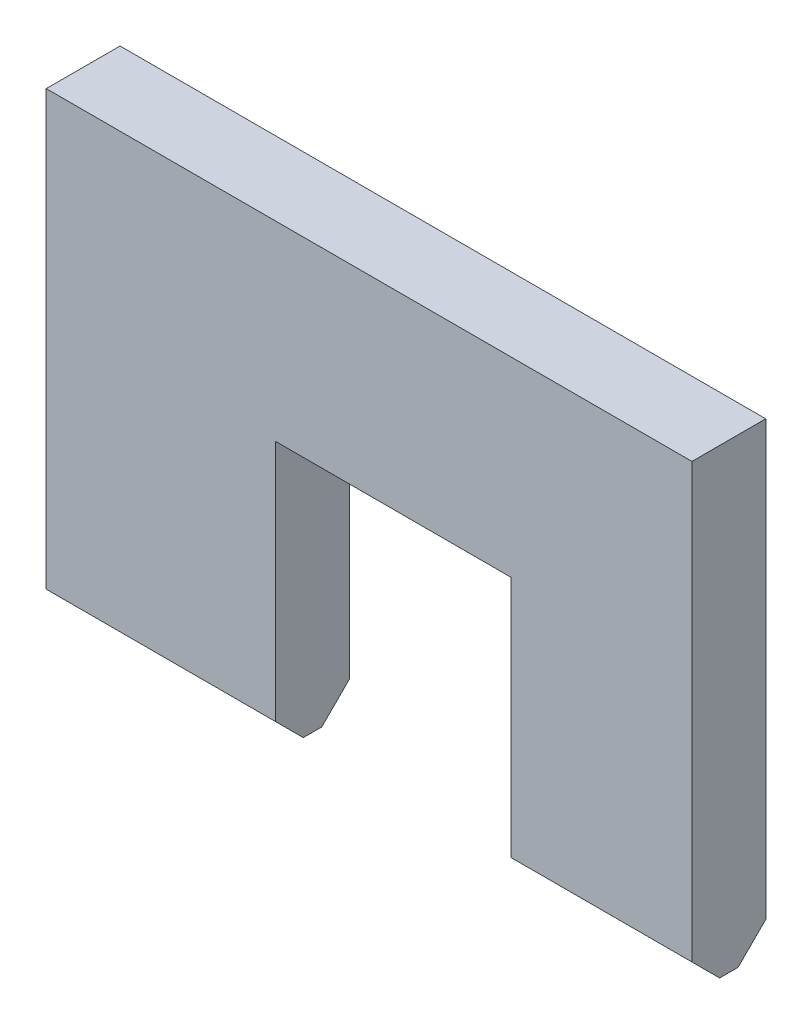
ISO-10303-21;
HEADER;
FILE_DESCRIPTION(('STEP AP214'),'2;1');
FILE_NAME('part.step','',(''),(''),'','','');
FILE_SCHEMA(('AUTOMOTIVE_DESIGN { 1 0 10303 214 1 1 1 1 }'));
ENDSEC;
DATA;
#1=APPLICATION_CONTEXT('core data for automotive mechanical design processes');
#2=APPLICATION_PROTOCOL_DEFINITION('international standard','automotive_design',2000,#1);
#3=PRODUCT_CONTEXT('',#1,'mechanical');
#4=PRODUCT('Part','Part','',(#3));
#5=PRODUCT_RELATED_PRODUCT_CATEGORY('part','',(#4));
#6=PRODUCT_DEFINITION_FORMATION('','',#4);
#7=PRODUCT_DEFINITION_CONTEXT('part definition',#1,'design');
#8=PRODUCT_DEFINITION('design','',#6,#7);
#9=PRODUCT_DEFINITION_SHAPE('','',#8);
#10=(LENGTH_UNIT() NAMED_UNIT(*) SI_UNIT(.MILLI.,.METRE.));
#11=(NAMED_UNIT(*) PLANE_ANGLE_UNIT() SI_UNIT($,.RADIAN.));
#12=(NAMED_UNIT(*) SI_UNIT($,.STERADIAN.) SOLID_ANGLE_UNIT());
#13=UNCERTAINTY_MEASURE_WITH_UNIT(LENGTH_MEASURE(1.E-05),#10,'distance_accuracy_value','');
#14=(GEOMETRIC_REPRESENTATION_CONTEXT(3) GLOBAL_UNCERTAINTY_ASSIGNED_CONTEXT((#13)) GLOBAL_UNIT_ASSIGNED_CONTEXT((#10,
#11,#12)) REPRESENTATION_CONTEXT('',''));
#15=CARTESIAN_POINT('',(0.,0.,0.));
#16=DIRECTION('',(0.,0.,1.));
#17=DIRECTION('',(1.,0.,0.));
#18=AXIS2_PLACEMENT_3D('',#15,#16,#17);
#19=CARTESIAN_POINT('',(0.,0.,0.));
#20=DIRECTION('',(0.,1.,0.));
#21=DIRECTION('',(0.,0.,1.));
#22=AXIS2_PLACEMENT_3D('',#19,#20,#21);
#23=PLANE('',#22);
#24=DIRECTION('',(1.,0.,0.));
#25=VECTOR('',#24,1.);
#26=CARTESIAN_POINT('',(0.,0.,-0.499999999999994));
#27=LINE('',#26,#25);
#28=CARTESIAN_POINT('',(-17.5,0.,-0.499999999999993));
#29=VERTEX_POINT('',#28);
#30=CARTESIAN_POINT('',(-5.06618432478945,0.,-0.499999999999994));
#31=VERTEX_POINT('',#30);
#32=EDGE_CURVE('E192',#29,#31,#27,.T.);
#33=ORIENTED_EDGE('',*,*,#32,.T.);
#34=DIRECTION('',(0.,0.,1.));
#35=VECTOR('',#34,1.);
#36=CARTESIAN_POINT('',(-5.06618432478945,0.,0.));
#37=LINE('',#36,#35);
#38=CARTESIAN_POINT('',(-5.06618432478945,0.,0.500000000000006));
#39=VERTEX_POINT('',#38);
#40=EDGE_CURVE('E157',#31,#39,#37,.T.);
#41=ORIENTED_EDGE('',*,*,#40,.T.);
#42=DIRECTION('',(-1.,0.,0.));
#43=VECTOR('',#42,1.);
#44=CARTESIAN_POINT('',(-17.5,0.,0.500000000000003));
#45=LINE('',#44,#43);
#46=CARTESIAN_POINT('',(-17.5,0.,0.500000000000006));
#47=VERTEX_POINT('',#46);
#48=EDGE_CURVE('E195',#39,#47,#45,.T.);
#49=ORIENTED_EDGE('',*,*,#48,.T.);
#50=DIRECTION('',(0.,0.,-1.));
#51=VECTOR('',#50,1.);
#52=CARTESIAN_POINT('',(-17.5,0.,2.));
#53=LINE('',#52,#51);
#54=EDGE_CURVE('E169',#47,#29,#53,.T.);
#55=ORIENTED_EDGE('',*,*,#54,.T.);
#56=EDGE_LOOP('',(#33,#41,#49,#55));
#57=FACE_BOUND('',#56,.T.);
#58=ADVANCED_FACE('F36',(#57),#23,.F.);
#59=CARTESIAN_POINT('',(0.,0.,0.5));
#60=DIRECTION('',(0.,-0.707106781186546,0.707106781186549));
#61=DIRECTION('',(1.,0.,0.));
#62=AXIS2_PLACEMENT_3D('',#59,#60,#61);
#63=PLANE('',#62);
#64=DIRECTION('',(0.,-0.707106781186549,-0.707106781186546));
#65=VECTOR('',#64,1.);
#66=CARTESIAN_POINT('',(-5.06618432478945,0.,0.500000000000001));
#67=LINE('',#66,#65);
#68=CARTESIAN_POINT('',(-5.06618432478945,1.5,2.));
#69=VERTEX_POINT('',#68);
#70=EDGE_CURVE('E160',#69,#39,#67,.T.);
#71=ORIENTED_EDGE('',*,*,#70,.F.);
#72=DIRECTION('',(1.,0.,0.));
#73=VECTOR('',#72,1.);
#74=CARTESIAN_POINT('',(17.5,1.5,2.));
#75=LINE('',#74,#73);
#76=CARTESIAN_POINT('',(-17.5,1.5,2.));
#77=VERTEX_POINT('',#76);
#78=EDGE_CURVE('E204',#77,#69,#75,.T.);
#79=ORIENTED_EDGE('',*,*,#78,.F.);
#80=DIRECTION('',(0.,0.707106781186549,0.707106781186546));
#81=VECTOR('',#80,1.);
#82=CARTESIAN_POINT('',(-17.5,13.2500000000001,13.75));
#83=LINE('',#82,#81);
#84=EDGE_CURVE('E201',#47,#77,#83,.T.);
#85=ORIENTED_EDGE('',*,*,#84,.F.);
#86=ORIENTED_EDGE('',*,*,#48,.F.);
#87=EDGE_LOOP('',(#71,#79,#85,#86));
#88=FACE_BOUND('',#87,.T.);
#89=ADVANCED_FACE('F241',(#88),#63,.T.);
#90=CARTESIAN_POINT('',(17.5,1.5,-2.));
#91=DIRECTION('',(0.,0.707106781186548,0.707106781186547));
#92=DIRECTION('',(-1.,0.,0.));
#93=AXIS2_PLACEMENT_3D('',#90,#91,#92);
#94=PLANE('',#93);
#95=DIRECTION('',(0.,-0.707106781186547,0.707106781186548));
#96=VECTOR('',#95,1.);
#97=CARTESIAN_POINT('',(-5.06618432478945,1.5,-2.));
#98=LINE('',#97,#96);
#99=CARTESIAN_POINT('',(-5.06618432478945,1.5,-2.));
#100=VERTEX_POINT('',#99);
#101=EDGE_CURVE('E44',#31,#100,#98,.F.);
#102=ORIENTED_EDGE('',*,*,#101,.F.);
#103=ORIENTED_EDGE('',*,*,#32,.F.);
#104=DIRECTION('',(0.,0.707106781186547,-0.707106781186548));
#105=VECTOR('',#104,1.);
#106=CARTESIAN_POINT('',(-17.5,11.25,-11.75));
#107=LINE('',#106,#105);
#108=CARTESIAN_POINT('',(-17.5,1.50000000000001,-2.));
#109=VERTEX_POINT('',#108);
#110=EDGE_CURVE('E199',#109,#29,#107,.F.);
#111=ORIENTED_EDGE('',*,*,#110,.F.);
#112=DIRECTION('',(-1.,0.,0.));
#113=VECTOR('',#112,1.);
#114=CARTESIAN_POINT('',(17.5,1.5,-2.));
#115=LINE('',#114,#113);
#116=EDGE_CURVE('E210',#100,#109,#115,.T.);
#117=ORIENTED_EDGE('',*,*,#116,.F.);
#118=EDGE_LOOP('',(#102,#103,#111,#117));
#119=FACE_BOUND('',#118,.T.);
#120=ADVANCED_FACE('F247',(#119),#94,.F.);
#121=CARTESIAN_POINT('',(17.5,25.,2.));
#122=DIRECTION('',(-1.,0.,0.));
#123=DIRECTION('',(0.,0.,1.));
#124=AXIS2_PLACEMENT_3D('',#121,#122,#123);
#125=PLANE('',#124);
#126=DIRECTION('',(0.,-1.,0.));
#127=VECTOR('',#126,1.);
#128=CARTESIAN_POINT('',(17.5,25.,2.));
#129=LINE('',#128,#127);
#130=CARTESIAN_POINT('',(17.5,25.,2.));
#131=VERTEX_POINT('',#130);
#132=CARTESIAN_POINT('',(17.5,1.5,2.));
#133=VERTEX_POINT('',#132);
#134=EDGE_CURVE('E177',#131,#133,#129,.T.);
#135=ORIENTED_EDGE('',*,*,#134,.T.);
#136=DIRECTION('',(0.,-0.707106781186549,-0.707106781186546));
#137=VECTOR('',#136,1.);
#138=CARTESIAN_POINT('',(17.5,0.,0.499999999999999));
#139=LINE('',#138,#137);
#140=CARTESIAN_POINT('',(17.5,0.,0.499999999999998));
#141=VERTEX_POINT('',#140);
#142=EDGE_CURVE('E208',#133,#141,#139,.T.);
#143=ORIENTED_EDGE('',*,*,#142,.T.);
#144=DIRECTION('',(0.,0.,-1.));
#145=VECTOR('',#144,1.);
#146=CARTESIAN_POINT('',(17.5,0.,2.));
#147=LINE('',#146,#145);
#148=CARTESIAN_POINT('',(17.5,0.,-0.499999999999996));
#149=VERTEX_POINT('',#148);
#150=EDGE_CURVE('E164',#141,#149,#147,.T.);
#151=ORIENTED_EDGE('',*,*,#150,.T.);
#152=DIRECTION('',(0.,-0.707106781186547,0.707106781186548));
#153=VECTOR('',#152,1.);
#154=CARTESIAN_POINT('',(17.5,1.5,-2.));
#155=LINE('',#154,#153);
#156=CARTESIAN_POINT('',(17.5,1.50000000000001,-2.00000000000001));
#157=VERTEX_POINT('',#156);
#158=EDGE_CURVE('E59',#149,#157,#155,.F.);
#159=ORIENTED_EDGE('',*,*,#158,.T.);
#160=DIRECTION('',(0.,-1.,0.));
#161=VECTOR('',#160,1.);
#162=CARTESIAN_POINT('',(17.5,25.,-2.));
#163=LINE('',#162,#161);
#164=CARTESIAN_POINT('',(17.5,25.,-2.));
#165=VERTEX_POINT('',#164);
#166=EDGE_CURVE('E189',#165,#157,#163,.T.);
#167=ORIENTED_EDGE('',*,*,#166,.F.);
#168=DIRECTION('',(0.,0.,-1.));
#169=VECTOR('',#168,1.);
#170=CARTESIAN_POINT('',(17.5,25.,2.));
#171=LINE('',#170,#169);
#172=EDGE_CURVE('E165',#131,#165,#171,.T.);
#173=ORIENTED_EDGE('',*,*,#172,.F.);
#174=EDGE_LOOP('',(#135,#143,#151,#159,#167,#173));
#175=FACE_BOUND('',#174,.T.);
#176=ADVANCED_FACE('F225',(#175),#125,.F.);
#177=CARTESIAN_POINT('',(17.5,25.,-2.));
#178=DIRECTION('',(0.,0.,1.));
#179=DIRECTION('',(1.,0.,0.));
#180=AXIS2_PLACEMENT_3D('',#177,#178,#179);
#181=PLANE('',#180);
#182=DIRECTION('',(1.,0.,0.));
#183=VECTOR('',#182,1.);
#184=CARTESIAN_POINT('',(-5.06618432478945,14.6557404701184,-2.));
#185=LINE('',#184,#183);
#186=CARTESIAN_POINT('',(-5.06618432478945,14.6557404701184,-2.));
#187=VERTEX_POINT('',#186);
#188=CARTESIAN_POINT('',(7.67795420074435,14.6557404701184,-2.));
#189=VERTEX_POINT('',#188);
#190=EDGE_CURVE('E131',#187,#189,#185,.T.);
#191=ORIENTED_EDGE('',*,*,#190,.F.);
#192=DIRECTION('',(0.,1.,0.));
#193=VECTOR('',#192,1.);
#194=CARTESIAN_POINT('',(-5.06618432478945,-2.65336903743218,-2.));
#195=LINE('',#194,#193);
#196=EDGE_CURVE('E138',#100,#187,#195,.T.);
#197=ORIENTED_EDGE('',*,*,#196,.F.);
#198=ORIENTED_EDGE('',*,*,#116,.T.);
#199=DIRECTION('',(0.,-1.,0.));
#200=VECTOR('',#199,1.);
#201=CARTESIAN_POINT('',(-17.5,25.,-2.));
#202=LINE('',#201,#200);
#203=CARTESIAN_POINT('',(-17.5,25.,-2.));
#204=VERTEX_POINT('',#203);
#205=EDGE_CURVE('E186',#204,#109,#202,.T.);
#206=ORIENTED_EDGE('',*,*,#205,.F.);
#207=DIRECTION('',(-1.,0.,0.));
#208=VECTOR('',#207,1.);
#209=CARTESIAN_POINT('',(17.5,25.,-2.));
#210=LINE('',#209,#208);
#211=EDGE_CURVE('E168',#165,#204,#210,.T.);
#212=ORIENTED_EDGE('',*,*,#211,.F.);
#213=ORIENTED_EDGE('',*,*,#166,.T.);
#214=CARTESIAN_POINT('',(7.67795420074435,1.5,-2.));
#215=VERTEX_POINT('',#214);
#216=EDGE_CURVE('E211',#157,#215,#115,.T.);
#217=ORIENTED_EDGE('',*,*,#216,.T.);
#218=DIRECTION('',(0.,-1.,0.));
#219=VECTOR('',#218,1.);
#220=CARTESIAN_POINT('',(7.67795420074435,-2.65336903743218,-2.));
#221=LINE('',#220,#219);
#222=EDGE_CURVE('E51',#189,#215,#221,.T.);
#223=ORIENTED_EDGE('',*,*,#222,.F.);
#224=EDGE_LOOP('',(#191,#197,#198,#206,#212,#213,#217,#223));
#225=FACE_BOUND('',#224,.T.);
#226=ADVANCED_FACE('F144',(#225),#181,.F.);
#227=CARTESIAN_POINT('',(-17.5,25.,2.));
#228=DIRECTION('',(-1.,0.,0.));
#229=DIRECTION('',(0.,0.,1.));
#230=AXIS2_PLACEMENT_3D('',#227,#228,#229);
#231=PLANE('',#230);
#232=ORIENTED_EDGE('',*,*,#54,.F.);
#233=ORIENTED_EDGE('',*,*,#84,.T.);
#234=DIRECTION('',(0.,-1.,0.));
#235=VECTOR('',#234,1.);
#236=CARTESIAN_POINT('',(-17.5,25.,2.));
#237=LINE('',#236,#235);
#238=CARTESIAN_POINT('',(-17.5,25.,2.));
#239=VERTEX_POINT('',#238);
#240=EDGE_CURVE('E183',#239,#77,#237,.T.);
#241=ORIENTED_EDGE('',*,*,#240,.F.);
#242=DIRECTION('',(0.,0.,-1.));
#243=VECTOR('',#242,1.);
#244=CARTESIAN_POINT('',(-17.5,25.,2.));
#245=LINE('',#244,#243);
#246=EDGE_CURVE('E171',#239,#204,#245,.T.);
#247=ORIENTED_EDGE('',*,*,#246,.T.);
#248=ORIENTED_EDGE('',*,*,#205,.T.);
#249=ORIENTED_EDGE('',*,*,#110,.T.);
#250=EDGE_LOOP('',(#232,#233,#241,#247,#248,#249));
#251=FACE_BOUND('',#250,.T.);
#252=ADVANCED_FACE('F250',(#251),#231,.T.);
#253=CARTESIAN_POINT('',(17.5,25.,2.));
#254=DIRECTION('',(0.,0.,1.));
#255=DIRECTION('',(1.,0.,0.));
#256=AXIS2_PLACEMENT_3D('',#253,#254,#255);
#257=PLANE('',#256);
#258=DIRECTION('',(0.,-1.,0.));
#259=VECTOR('',#258,1.);
#260=CARTESIAN_POINT('',(-5.06618432478945,25.,2.));
#261=LINE('',#260,#259);
#262=CARTESIAN_POINT('',(-5.06618432478945,14.6557404701184,2.));
#263=VERTEX_POINT('',#262);
#264=EDGE_CURVE('E162',#263,#69,#261,.T.);
#265=ORIENTED_EDGE('',*,*,#264,.F.);
#266=DIRECTION('',(-1.,0.,0.));
#267=VECTOR('',#266,1.);
#268=CARTESIAN_POINT('',(17.5,14.6557404701184,2.));
#269=LINE('',#268,#267);
#270=CARTESIAN_POINT('',(7.67795420074435,14.6557404701184,2.));
#271=VERTEX_POINT('',#270);
#272=EDGE_CURVE('E11',#271,#263,#269,.T.);
#273=ORIENTED_EDGE('',*,*,#272,.F.);
#274=DIRECTION('',(0.,1.,0.));
#275=VECTOR('',#274,1.);
#276=CARTESIAN_POINT('',(7.67795420074435,25.,2.));
#277=LINE('',#276,#275);
#278=CARTESIAN_POINT('',(7.67795420074435,1.5,2.));
#279=VERTEX_POINT('',#278);
#280=EDGE_CURVE('E155',#279,#271,#277,.T.);
#281=ORIENTED_EDGE('',*,*,#280,.F.);
#282=EDGE_CURVE('E203',#279,#133,#75,.T.);
#283=ORIENTED_EDGE('',*,*,#282,.T.);
#284=ORIENTED_EDGE('',*,*,#134,.F.);
#285=DIRECTION('',(-1.,0.,0.));
#286=VECTOR('',#285,1.);
#287=CARTESIAN_POINT('',(17.5,25.,2.));
#288=LINE('',#287,#286);
#289=EDGE_CURVE('E174',#131,#239,#288,.T.);
#290=ORIENTED_EDGE('',*,*,#289,.T.);
#291=ORIENTED_EDGE('',*,*,#240,.T.);
#292=ORIENTED_EDGE('',*,*,#78,.T.);
#293=EDGE_LOOP('',(#265,#273,#281,#283,#284,#290,#291,#292));
#294=FACE_BOUND('',#293,.T.);
#295=ADVANCED_FACE('F232',(#294),#257,.T.);
#296=CARTESIAN_POINT('',(0.,25.,0.));
#297=DIRECTION('',(0.,1.,0.));
#298=DIRECTION('',(0.,0.,1.));
#299=AXIS2_PLACEMENT_3D('',#296,#297,#298);
#300=PLANE('',#299);
#301=ORIENTED_EDGE('',*,*,#172,.T.);
#302=ORIENTED_EDGE('',*,*,#211,.T.);
#303=ORIENTED_EDGE('',*,*,#246,.F.);
#304=ORIENTED_EDGE('',*,*,#289,.F.);
#305=EDGE_LOOP('',(#301,#302,#303,#304));
#306=FACE_BOUND('',#305,.T.);
#307=ADVANCED_FACE('F230',(#306),#300,.T.);
#308=CARTESIAN_POINT('',(7.67795420074435,0.,0.500000000000006));
#309=VERTEX_POINT('',#308);
#310=EDGE_CURVE('E196',#141,#309,#45,.T.);
#311=ORIENTED_EDGE('',*,*,#310,.T.);
#312=DIRECTION('',(0.,0.,-1.));
#313=VECTOR('',#312,1.);
#314=CARTESIAN_POINT('',(7.67795420074435,0.,0.));
#315=LINE('',#314,#313);
#316=CARTESIAN_POINT('',(7.67795420074435,0.,-0.499999999999995));
#317=VERTEX_POINT('',#316);
#318=EDGE_CURVE('E149',#309,#317,#315,.T.);
#319=ORIENTED_EDGE('',*,*,#318,.T.);
#320=EDGE_CURVE('E191',#317,#149,#27,.T.);
#321=ORIENTED_EDGE('',*,*,#320,.T.);
#322=ORIENTED_EDGE('',*,*,#150,.F.);
#323=EDGE_LOOP('',(#311,#319,#321,#322));
#324=FACE_BOUND('',#323,.T.);
#325=ADVANCED_FACE('F220',(#324),#23,.F.);
#326=DIRECTION('',(0.,0.707106781186549,0.707106781186546));
#327=VECTOR('',#326,1.);
#328=CARTESIAN_POINT('',(7.67795420074435,0.,0.499999999999999));
#329=LINE('',#328,#327);
#330=EDGE_CURVE('E153',#309,#279,#329,.T.);
#331=ORIENTED_EDGE('',*,*,#330,.F.);
#332=ORIENTED_EDGE('',*,*,#310,.F.);
#333=ORIENTED_EDGE('',*,*,#142,.F.);
#334=ORIENTED_EDGE('',*,*,#282,.F.);
#335=EDGE_LOOP('',(#331,#332,#333,#334));
#336=FACE_BOUND('',#335,.T.);
#337=ADVANCED_FACE('F237',(#336),#63,.T.);
#338=DIRECTION('',(0.,0.707106781186547,-0.707106781186548));
#339=VECTOR('',#338,1.);
#340=CARTESIAN_POINT('',(7.67795420074435,1.5,-2.));
#341=LINE('',#340,#339);
#342=EDGE_CURVE('E213',#215,#317,#341,.F.);
#343=ORIENTED_EDGE('',*,*,#342,.F.);
#344=ORIENTED_EDGE('',*,*,#216,.F.);
#345=ORIENTED_EDGE('',*,*,#158,.F.);
#346=ORIENTED_EDGE('',*,*,#320,.F.);
#347=EDGE_LOOP('',(#343,#344,#345,#346));
#348=FACE_BOUND('',#347,.T.);
#349=ADVANCED_FACE('F38',(#348),#94,.F.);
#350=CARTESIAN_POINT('',(-5.06618432478945,-2.65336903743218,8.));
#351=DIRECTION('',(-1.,0.,0.));
#352=DIRECTION('',(0.,0.,1.));
#353=AXIS2_PLACEMENT_3D('',#350,#351,#352);
#354=PLANE('',#353);
#355=ORIENTED_EDGE('',*,*,#264,.T.);
#356=ORIENTED_EDGE('',*,*,#70,.T.);
#357=ORIENTED_EDGE('',*,*,#40,.F.);
#358=ORIENTED_EDGE('',*,*,#101,.T.);
#359=ORIENTED_EDGE('',*,*,#196,.T.);
#360=DIRECTION('',(0.,0.,-1.));
#361=VECTOR('',#360,1.);
#362=CARTESIAN_POINT('',(-5.06618432478945,14.6557404701184,8.));
#363=LINE('',#362,#361);
#364=EDGE_CURVE('E126',#263,#187,#363,.T.);
#365=ORIENTED_EDGE('',*,*,#364,.F.);
#366=EDGE_LOOP('',(#355,#356,#357,#358,#359,#365));
#367=FACE_BOUND('',#366,.T.);
#368=ADVANCED_FACE('F139',(#367),#354,.F.);
#369=CARTESIAN_POINT('',(7.67795420074435,-2.65336903743218,8.));
#370=DIRECTION('',(1.,0.,0.));
#371=DIRECTION('',(0.,0.,-1.));
#372=AXIS2_PLACEMENT_3D('',#369,#370,#371);
#373=PLANE('',#372);
#374=ORIENTED_EDGE('',*,*,#280,.T.);
#375=DIRECTION('',(0.,0.,-1.));
#376=VECTOR('',#375,1.);
#377=CARTESIAN_POINT('',(7.67795420074435,14.6557404701184,8.));
#378=LINE('',#377,#376);
#379=EDGE_CURVE('E135',#271,#189,#378,.T.);
#380=ORIENTED_EDGE('',*,*,#379,.T.);
#381=ORIENTED_EDGE('',*,*,#222,.T.);
#382=ORIENTED_EDGE('',*,*,#342,.T.);
#383=ORIENTED_EDGE('',*,*,#318,.F.);
#384=ORIENTED_EDGE('',*,*,#330,.T.);
#385=EDGE_LOOP('',(#374,#380,#381,#382,#383,#384));
#386=FACE_BOUND('',#385,.T.);
#387=ADVANCED_FACE('F214',(#386),#373,.F.);
#388=CARTESIAN_POINT('',(-5.06618432478945,14.6557404701184,8.));
#389=DIRECTION('',(0.,1.,0.));
#390=DIRECTION('',(0.,0.,1.));
#391=AXIS2_PLACEMENT_3D('',#388,#389,#390);
#392=PLANE('',#391);
#393=ORIENTED_EDGE('',*,*,#272,.T.);
#394=ORIENTED_EDGE('',*,*,#364,.T.);
#395=ORIENTED_EDGE('',*,*,#190,.T.);
#396=ORIENTED_EDGE('',*,*,#379,.F.);
#397=EDGE_LOOP('',(#393,#394,#395,#396));
#398=FACE_BOUND('',#397,.T.);
#399=ADVANCED_FACE('F128',(#398),#392,.F.);
#400=CLOSED_SHELL('',(#58,#89,#120,#176,#226,#252,#295,#307,#325,#337,#349,#368,#387,#399));
#401=MANIFOLD_SOLID_BREP('B2',#400);
#402=ADVANCED_BREP_SHAPE_REPRESENTATION('',(#18,#401),#14);
#403=SHAPE_DEFINITION_REPRESENTATION(#9,#402);
ENDSEC;
END-ISO-10303-21;
